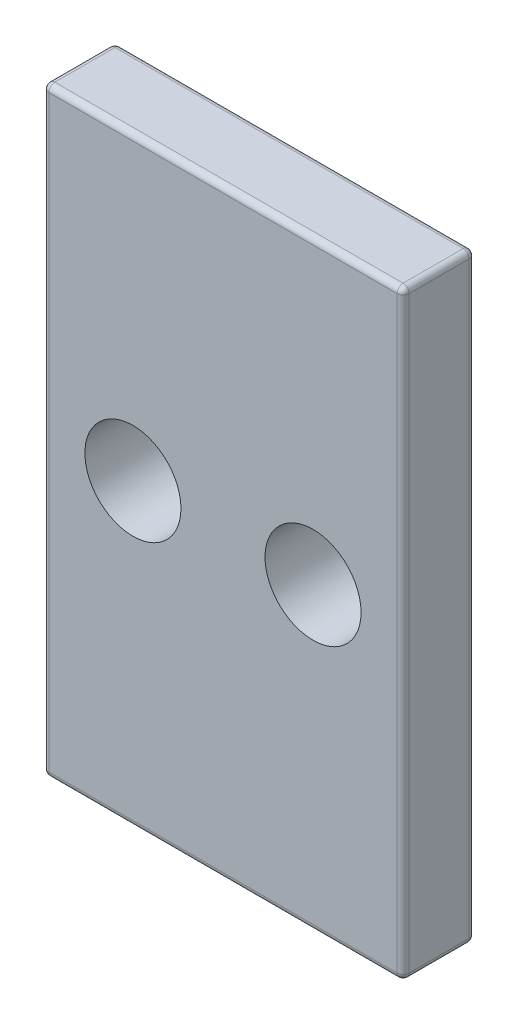
ISO-10303-21;
HEADER;
FILE_DESCRIPTION(('STEP AP214'),'2;1');
FILE_NAME('part.step','',(''),(''),'','','');
FILE_SCHEMA(('AUTOMOTIVE_DESIGN { 1 0 10303 214 1 1 1 1 }'));
ENDSEC;
DATA;
#1=APPLICATION_CONTEXT('core data for automotive mechanical design processes');
#2=APPLICATION_PROTOCOL_DEFINITION('international standard','automotive_design',2000,#1);
#3=PRODUCT_CONTEXT('',#1,'mechanical');
#4=PRODUCT('Part','Part','',(#3));
#5=PRODUCT_RELATED_PRODUCT_CATEGORY('part','',(#4));
#6=PRODUCT_DEFINITION_FORMATION('','',#4);
#7=PRODUCT_DEFINITION_CONTEXT('part definition',#1,'design');
#8=PRODUCT_DEFINITION('design','',#6,#7);
#9=PRODUCT_DEFINITION_SHAPE('','',#8);
#10=(LENGTH_UNIT() NAMED_UNIT(*) SI_UNIT(.MILLI.,.METRE.));
#11=(NAMED_UNIT(*) PLANE_ANGLE_UNIT() SI_UNIT($,.RADIAN.));
#12=(NAMED_UNIT(*) SI_UNIT($,.STERADIAN.) SOLID_ANGLE_UNIT());
#13=UNCERTAINTY_MEASURE_WITH_UNIT(LENGTH_MEASURE(1.E-05),#10,'distance_accuracy_value','');
#14=(GEOMETRIC_REPRESENTATION_CONTEXT(3) GLOBAL_UNCERTAINTY_ASSIGNED_CONTEXT((#13)) GLOBAL_UNIT_ASSIGNED_CONTEXT((#10,
#11,#12)) REPRESENTATION_CONTEXT('',''));
#15=CARTESIAN_POINT('',(0.,0.,0.));
#16=DIRECTION('',(0.,0.,1.));
#17=DIRECTION('',(1.,0.,0.));
#18=AXIS2_PLACEMENT_3D('',#15,#16,#17);
#19=CARTESIAN_POINT('',(0.,0.,6.));
#20=DIRECTION('',(0.,0.,1.));
#21=DIRECTION('',(1.,0.,0.));
#22=AXIS2_PLACEMENT_3D('',#19,#20,#21);
#23=PLANE('',#22);
#24=DIRECTION('',(0.,1.,0.));
#25=VECTOR('',#24,1.);
#26=CARTESIAN_POINT('',(14.5,25.,6.));
#27=LINE('',#26,#25);
#28=CARTESIAN_POINT('',(14.5,-24.5,6.));
#29=VERTEX_POINT('',#28);
#30=CARTESIAN_POINT('',(14.5,24.5,6.));
#31=VERTEX_POINT('',#30);
#32=EDGE_CURVE('E171',#29,#31,#27,.T.);
#33=ORIENTED_EDGE('',*,*,#32,.T.);
#34=DIRECTION('',(-1.,0.,0.));
#35=VECTOR('',#34,1.);
#36=CARTESIAN_POINT('',(-15.,24.5,6.));
#37=LINE('',#36,#35);
#38=CARTESIAN_POINT('',(-14.5,24.5,6.));
#39=VERTEX_POINT('',#38);
#40=EDGE_CURVE('E140',#31,#39,#37,.T.);
#41=ORIENTED_EDGE('',*,*,#40,.T.);
#42=DIRECTION('',(0.,-1.,0.));
#43=VECTOR('',#42,1.);
#44=CARTESIAN_POINT('',(-14.5,-25.,6.));
#45=LINE('',#44,#43);
#46=CARTESIAN_POINT('',(-14.5,-24.5,6.));
#47=VERTEX_POINT('',#46);
#48=EDGE_CURVE('E159',#39,#47,#45,.T.);
#49=ORIENTED_EDGE('',*,*,#48,.T.);
#50=DIRECTION('',(1.,0.,0.));
#51=VECTOR('',#50,1.);
#52=CARTESIAN_POINT('',(15.,-24.5,6.));
#53=LINE('',#52,#51);
#54=EDGE_CURVE('E166',#47,#29,#53,.T.);
#55=ORIENTED_EDGE('',*,*,#54,.T.);
#56=EDGE_LOOP('',(#33,#41,#49,#55));
#57=FACE_BOUND('',#56,.T.);
#58=CARTESIAN_POINT('',(-7.5,0.,6.));
#59=DIRECTION('',(0.,0.,1.));
#60=DIRECTION('',(1.,0.,0.));
#61=AXIS2_PLACEMENT_3D('',#58,#59,#60);
#62=CIRCLE('',#61,4.);
#63=CARTESIAN_POINT('',(-3.5,0.,6.));
#64=VERTEX_POINT('',#63);
#65=EDGE_CURVE('E167',#64,#64,#62,.T.);
#66=ORIENTED_EDGE('',*,*,#65,.F.);
#67=EDGE_LOOP('',(#66));
#68=FACE_BOUND('',#67,.T.);
#69=CARTESIAN_POINT('',(7.5,0.,6.));
#70=DIRECTION('',(0.,0.,1.));
#71=DIRECTION('',(1.,0.,0.));
#72=AXIS2_PLACEMENT_3D('',#69,#70,#71);
#73=CIRCLE('',#72,4.);
#74=CARTESIAN_POINT('',(11.5,0.,6.));
#75=VERTEX_POINT('',#74);
#76=EDGE_CURVE('E320',#75,#75,#73,.T.);
#77=ORIENTED_EDGE('',*,*,#76,.F.);
#78=EDGE_LOOP('',(#77));
#79=FACE_BOUND('',#78,.T.);
#80=ADVANCED_FACE('F45',(#57,#68,#79),#23,.T.);
#81=CARTESIAN_POINT('',(0.,0.,0.));
#82=DIRECTION('',(0.,0.,1.));
#83=DIRECTION('',(1.,0.,0.));
#84=AXIS2_PLACEMENT_3D('',#81,#82,#83);
#85=PLANE('',#84);
#86=DIRECTION('',(0.,-1.,0.));
#87=VECTOR('',#86,1.);
#88=CARTESIAN_POINT('',(-14.5,0.,0.));
#89=LINE('',#88,#87);
#90=CARTESIAN_POINT('',(-14.5,-24.5,0.));
#91=VERTEX_POINT('',#90);
#92=CARTESIAN_POINT('',(-14.5,24.5,0.));
#93=VERTEX_POINT('',#92);
#94=EDGE_CURVE('E190',#91,#93,#89,.F.);
#95=ORIENTED_EDGE('',*,*,#94,.T.);
#96=DIRECTION('',(-1.,0.,0.));
#97=VECTOR('',#96,1.);
#98=CARTESIAN_POINT('',(0.,24.5,0.));
#99=LINE('',#98,#97);
#100=CARTESIAN_POINT('',(14.5,24.5,0.));
#101=VERTEX_POINT('',#100);
#102=EDGE_CURVE('E199',#93,#101,#99,.F.);
#103=ORIENTED_EDGE('',*,*,#102,.T.);
#104=DIRECTION('',(0.,1.,0.));
#105=VECTOR('',#104,1.);
#106=CARTESIAN_POINT('',(14.5,0.,0.));
#107=LINE('',#106,#105);
#108=CARTESIAN_POINT('',(14.5,-24.5,0.));
#109=VERTEX_POINT('',#108);
#110=EDGE_CURVE('E196',#101,#109,#107,.F.);
#111=ORIENTED_EDGE('',*,*,#110,.T.);
#112=DIRECTION('',(1.,0.,0.));
#113=VECTOR('',#112,1.);
#114=CARTESIAN_POINT('',(0.,-24.5,0.));
#115=LINE('',#114,#113);
#116=EDGE_CURVE('E193',#109,#91,#115,.F.);
#117=ORIENTED_EDGE('',*,*,#116,.T.);
#118=EDGE_LOOP('',(#95,#103,#111,#117));
#119=FACE_BOUND('',#118,.T.);
#120=CARTESIAN_POINT('',(-7.5,0.,0.));
#121=DIRECTION('',(0.,0.,1.));
#122=DIRECTION('',(1.,0.,0.));
#123=AXIS2_PLACEMENT_3D('',#120,#121,#122);
#124=CIRCLE('',#123,4.);
#125=CARTESIAN_POINT('',(-3.5,0.,0.));
#126=VERTEX_POINT('',#125);
#127=EDGE_CURVE('E326',#126,#126,#124,.T.);
#128=ORIENTED_EDGE('',*,*,#127,.T.);
#129=EDGE_LOOP('',(#128));
#130=FACE_BOUND('',#129,.T.);
#131=CARTESIAN_POINT('',(7.5,0.,0.));
#132=DIRECTION('',(0.,0.,1.));
#133=DIRECTION('',(1.,0.,0.));
#134=AXIS2_PLACEMENT_3D('',#131,#132,#133);
#135=CIRCLE('',#134,4.);
#136=CARTESIAN_POINT('',(11.5,0.,0.));
#137=VERTEX_POINT('',#136);
#138=EDGE_CURVE('E313',#137,#137,#135,.T.);
#139=ORIENTED_EDGE('',*,*,#138,.T.);
#140=EDGE_LOOP('',(#139));
#141=FACE_BOUND('',#140,.T.);
#142=ADVANCED_FACE('F389',(#119,#130,#141),#85,.F.);
#143=CARTESIAN_POINT('',(15.,25.,6.));
#144=DIRECTION('',(-1.,0.,0.));
#145=DIRECTION('',(0.,-1.,0.));
#146=AXIS2_PLACEMENT_3D('',#143,#144,#145);
#147=PLANE('',#146);
#148=DIRECTION('',(0.,0.,-1.));
#149=VECTOR('',#148,1.);
#150=CARTESIAN_POINT('',(15.,24.5,6.));
#151=LINE('',#150,#149);
#152=CARTESIAN_POINT('',(15.,24.5,0.5));
#153=VERTEX_POINT('',#152);
#154=CARTESIAN_POINT('',(15.,24.5,5.5));
#155=VERTEX_POINT('',#154);
#156=EDGE_CURVE('E209',#153,#155,#151,.F.);
#157=ORIENTED_EDGE('',*,*,#156,.T.);
#158=DIRECTION('',(0.,1.,0.));
#159=VECTOR('',#158,1.);
#160=CARTESIAN_POINT('',(15.,-25.,5.5));
#161=LINE('',#160,#159);
#162=CARTESIAN_POINT('',(15.,-24.5,5.5));
#163=VERTEX_POINT('',#162);
#164=EDGE_CURVE('E212',#155,#163,#161,.F.);
#165=ORIENTED_EDGE('',*,*,#164,.T.);
#166=DIRECTION('',(0.,0.,-1.));
#167=VECTOR('',#166,1.);
#168=CARTESIAN_POINT('',(15.,-24.5,6.));
#169=LINE('',#168,#167);
#170=CARTESIAN_POINT('',(15.,-24.5,0.5));
#171=VERTEX_POINT('',#170);
#172=EDGE_CURVE('E203',#163,#171,#169,.T.);
#173=ORIENTED_EDGE('',*,*,#172,.T.);
#174=DIRECTION('',(0.,1.,0.));
#175=VECTOR('',#174,1.);
#176=CARTESIAN_POINT('',(15.,25.,0.5));
#177=LINE('',#176,#175);
#178=EDGE_CURVE('E206',#171,#153,#177,.T.);
#179=ORIENTED_EDGE('',*,*,#178,.T.);
#180=EDGE_LOOP('',(#157,#165,#173,#179));
#181=FACE_BOUND('',#180,.T.);
#182=ADVANCED_FACE('F395',(#181),#147,.F.);
#183=CARTESIAN_POINT('',(-15.,25.,6.));
#184=DIRECTION('',(0.,-1.,0.));
#185=DIRECTION('',(0.,0.,-1.));
#186=AXIS2_PLACEMENT_3D('',#183,#184,#185);
#187=PLANE('',#186);
#188=DIRECTION('',(-1.,0.,0.));
#189=VECTOR('',#188,1.);
#190=CARTESIAN_POINT('',(15.,25.,5.5));
#191=LINE('',#190,#189);
#192=CARTESIAN_POINT('',(-14.5,25.,5.5));
#193=VERTEX_POINT('',#192);
#194=CARTESIAN_POINT('',(14.5,25.,5.5));
#195=VERTEX_POINT('',#194);
#196=EDGE_CURVE('E142',#193,#195,#191,.F.);
#197=ORIENTED_EDGE('',*,*,#196,.T.);
#198=DIRECTION('',(0.,0.,-1.));
#199=VECTOR('',#198,1.);
#200=CARTESIAN_POINT('',(14.5,25.,6.));
#201=LINE('',#200,#199);
#202=CARTESIAN_POINT('',(14.5,25.,0.5));
#203=VERTEX_POINT('',#202);
#204=EDGE_CURVE('E187',#195,#203,#201,.T.);
#205=ORIENTED_EDGE('',*,*,#204,.T.);
#206=DIRECTION('',(-1.,0.,0.));
#207=VECTOR('',#206,1.);
#208=CARTESIAN_POINT('',(-15.,25.,0.5));
#209=LINE('',#208,#207);
#210=CARTESIAN_POINT('',(-14.5,25.,0.5));
#211=VERTEX_POINT('',#210);
#212=EDGE_CURVE('E178',#203,#211,#209,.T.);
#213=ORIENTED_EDGE('',*,*,#212,.T.);
#214=DIRECTION('',(0.,0.,-1.));
#215=VECTOR('',#214,1.);
#216=CARTESIAN_POINT('',(-14.5,25.,6.));
#217=LINE('',#216,#215);
#218=EDGE_CURVE('E174',#211,#193,#217,.F.);
#219=ORIENTED_EDGE('',*,*,#218,.T.);
#220=EDGE_LOOP('',(#197,#205,#213,#219));
#221=FACE_BOUND('',#220,.T.);
#222=ADVANCED_FACE('F359',(#221),#187,.F.);
#223=CARTESIAN_POINT('',(-15.,25.,6.));
#224=DIRECTION('',(1.,0.,0.));
#225=DIRECTION('',(0.,1.,0.));
#226=AXIS2_PLACEMENT_3D('',#223,#224,#225);
#227=PLANE('',#226);
#228=DIRECTION('',(0.,-1.,0.));
#229=VECTOR('',#228,1.);
#230=CARTESIAN_POINT('',(-15.,25.,5.5));
#231=LINE('',#230,#229);
#232=CARTESIAN_POINT('',(-15.,-24.5,5.5));
#233=VERTEX_POINT('',#232);
#234=CARTESIAN_POINT('',(-15.,24.5,5.5));
#235=VERTEX_POINT('',#234);
#236=EDGE_CURVE('E55',#233,#235,#231,.F.);
#237=ORIENTED_EDGE('',*,*,#236,.T.);
#238=DIRECTION('',(0.,0.,-1.));
#239=VECTOR('',#238,1.);
#240=CARTESIAN_POINT('',(-15.,24.5,6.));
#241=LINE('',#240,#239);
#242=CARTESIAN_POINT('',(-15.,24.5,0.5));
#243=VERTEX_POINT('',#242);
#244=EDGE_CURVE('E11',#235,#243,#241,.T.);
#245=ORIENTED_EDGE('',*,*,#244,.T.);
#246=DIRECTION('',(0.,-1.,0.));
#247=VECTOR('',#246,1.);
#248=CARTESIAN_POINT('',(-15.,25.,0.5));
#249=LINE('',#248,#247);
#250=CARTESIAN_POINT('',(-15.,-24.5,0.5));
#251=VERTEX_POINT('',#250);
#252=EDGE_CURVE('E229',#243,#251,#249,.T.);
#253=ORIENTED_EDGE('',*,*,#252,.T.);
#254=DIRECTION('',(0.,0.,-1.));
#255=VECTOR('',#254,1.);
#256=CARTESIAN_POINT('',(-15.,-24.5,6.));
#257=LINE('',#256,#255);
#258=EDGE_CURVE('E66',#251,#233,#257,.F.);
#259=ORIENTED_EDGE('',*,*,#258,.T.);
#260=EDGE_LOOP('',(#237,#245,#253,#259));
#261=FACE_BOUND('',#260,.T.);
#262=ADVANCED_FACE('F365',(#261),#227,.F.);
#263=CARTESIAN_POINT('',(-15.,-25.,6.));
#264=DIRECTION('',(0.,1.,0.));
#265=DIRECTION('',(0.,0.,1.));
#266=AXIS2_PLACEMENT_3D('',#263,#264,#265);
#267=PLANE('',#266);
#268=DIRECTION('',(0.,0.,-1.));
#269=VECTOR('',#268,1.);
#270=CARTESIAN_POINT('',(14.5,-25.,6.));
#271=LINE('',#270,#269);
#272=CARTESIAN_POINT('',(14.5,-25.,0.5));
#273=VERTEX_POINT('',#272);
#274=CARTESIAN_POINT('',(14.5,-25.,5.5));
#275=VERTEX_POINT('',#274);
#276=EDGE_CURVE('E222',#273,#275,#271,.F.);
#277=ORIENTED_EDGE('',*,*,#276,.T.);
#278=DIRECTION('',(1.,0.,0.));
#279=VECTOR('',#278,1.);
#280=CARTESIAN_POINT('',(-15.,-25.,5.5));
#281=LINE('',#280,#279);
#282=CARTESIAN_POINT('',(-14.5,-25.,5.5));
#283=VERTEX_POINT('',#282);
#284=EDGE_CURVE('E225',#275,#283,#281,.F.);
#285=ORIENTED_EDGE('',*,*,#284,.T.);
#286=DIRECTION('',(0.,0.,-1.));
#287=VECTOR('',#286,1.);
#288=CARTESIAN_POINT('',(-14.5,-25.,6.));
#289=LINE('',#288,#287);
#290=CARTESIAN_POINT('',(-14.5,-25.,0.5));
#291=VERTEX_POINT('',#290);
#292=EDGE_CURVE('E216',#283,#291,#289,.T.);
#293=ORIENTED_EDGE('',*,*,#292,.T.);
#294=DIRECTION('',(1.,0.,0.));
#295=VECTOR('',#294,1.);
#296=CARTESIAN_POINT('',(-15.,-25.,0.5));
#297=LINE('',#296,#295);
#298=EDGE_CURVE('E219',#291,#273,#297,.T.);
#299=ORIENTED_EDGE('',*,*,#298,.T.);
#300=EDGE_LOOP('',(#277,#285,#293,#299));
#301=FACE_BOUND('',#300,.T.);
#302=ADVANCED_FACE('F402',(#301),#267,.F.);
#303=CARTESIAN_POINT('',(-7.5,0.,6.));
#304=DIRECTION('',(0.,0.,-1.));
#305=DIRECTION('',(-1.,0.,0.));
#306=AXIS2_PLACEMENT_3D('',#303,#304,#305);
#307=CYLINDRICAL_SURFACE('',#306,4.);
#308=ORIENTED_EDGE('',*,*,#65,.T.);
#309=EDGE_LOOP('',(#308));
#310=FACE_BOUND('',#309,.T.);
#311=ORIENTED_EDGE('',*,*,#127,.F.);
#312=EDGE_LOOP('',(#311));
#313=FACE_BOUND('',#312,.T.);
#314=ADVANCED_FACE('F399',(#310,#313),#307,.F.);
#315=CARTESIAN_POINT('',(7.5,0.,6.));
#316=DIRECTION('',(0.,0.,-1.));
#317=DIRECTION('',(-1.,0.,0.));
#318=AXIS2_PLACEMENT_3D('',#315,#316,#317);
#319=CYLINDRICAL_SURFACE('',#318,4.);
#320=ORIENTED_EDGE('',*,*,#76,.T.);
#321=EDGE_LOOP('',(#320));
#322=FACE_BOUND('',#321,.T.);
#323=ORIENTED_EDGE('',*,*,#138,.F.);
#324=EDGE_LOOP('',(#323));
#325=FACE_BOUND('',#324,.T.);
#326=ADVANCED_FACE('F558',(#322,#325),#319,.F.);
#327=CARTESIAN_POINT('',(-15.,-24.5,0.5));
#328=DIRECTION('',(1.,0.,0.));
#329=DIRECTION('',(0.,0.,-1.));
#330=AXIS2_PLACEMENT_3D('',#327,#328,#329);
#331=CYLINDRICAL_SURFACE('',#330,0.5);
#332=CARTESIAN_POINT('',(14.5,-24.5,0.5));
#333=DIRECTION('',(1.,0.,0.));
#334=DIRECTION('',(0.,0.,-1.));
#335=AXIS2_PLACEMENT_3D('',#332,#333,#334);
#336=CIRCLE('',#335,0.5);
#337=EDGE_CURVE('E49',#273,#109,#336,.T.);
#338=ORIENTED_EDGE('',*,*,#337,.F.);
#339=ORIENTED_EDGE('',*,*,#298,.F.);
#340=CARTESIAN_POINT('',(-14.5,-24.5,0.5));
#341=DIRECTION('',(-1.,0.,0.));
#342=DIRECTION('',(0.,0.,1.));
#343=AXIS2_PLACEMENT_3D('',#340,#341,#342);
#344=CIRCLE('',#343,0.5);
#345=EDGE_CURVE('E304',#91,#291,#344,.T.);
#346=ORIENTED_EDGE('',*,*,#345,.F.);
#347=ORIENTED_EDGE('',*,*,#116,.F.);
#348=EDGE_LOOP('',(#338,#339,#346,#347));
#349=FACE_BOUND('',#348,.T.);
#350=ADVANCED_FACE('F47',(#349),#331,.T.);
#351=CARTESIAN_POINT('',(14.5,-24.5,0.5));
#352=DIRECTION('',(0.,0.,-1.));
#353=DIRECTION('',(-1.,0.,0.));
#354=AXIS2_PLACEMENT_3D('',#351,#352,#353);
#355=SPHERICAL_SURFACE('',#354,0.5);
#356=CARTESIAN_POINT('',(14.5,-24.5,0.5));
#357=DIRECTION('',(0.,0.,-1.));
#358=DIRECTION('',(-1.,0.,0.));
#359=AXIS2_PLACEMENT_3D('',#356,#357,#358);
#360=CIRCLE('',#359,0.5);
#361=EDGE_CURVE('E297',#273,#171,#360,.F.);
#362=ORIENTED_EDGE('',*,*,#361,.F.);
#363=ORIENTED_EDGE('',*,*,#337,.T.);
#364=CARTESIAN_POINT('',(14.5,-24.5,0.5));
#365=DIRECTION('',(0.,-1.,0.));
#366=DIRECTION('',(0.,0.,-1.));
#367=AXIS2_PLACEMENT_3D('',#364,#365,#366);
#368=CIRCLE('',#367,0.5);
#369=EDGE_CURVE('E301',#171,#109,#368,.F.);
#370=ORIENTED_EDGE('',*,*,#369,.F.);
#371=EDGE_LOOP('',(#362,#363,#370));
#372=FACE_BOUND('',#371,.T.);
#373=ADVANCED_FACE('F544',(#372),#355,.T.);
#374=CARTESIAN_POINT('',(-14.5,-24.5,0.5));
#375=DIRECTION('',(0.,-1.,0.));
#376=DIRECTION('',(0.,0.,-1.));
#377=AXIS2_PLACEMENT_3D('',#374,#375,#376);
#378=SPHERICAL_SURFACE('',#377,0.5);
#379=CARTESIAN_POINT('',(-14.5,-24.5,0.5));
#380=DIRECTION('',(0.,-1.,0.));
#381=DIRECTION('',(0.,0.,-1.));
#382=AXIS2_PLACEMENT_3D('',#379,#380,#381);
#383=CIRCLE('',#382,0.5);
#384=EDGE_CURVE('E289',#91,#251,#383,.F.);
#385=ORIENTED_EDGE('',*,*,#384,.F.);
#386=ORIENTED_EDGE('',*,*,#345,.T.);
#387=CARTESIAN_POINT('',(-14.5,-24.5,0.5));
#388=DIRECTION('',(0.,0.,-1.));
#389=DIRECTION('',(-1.,0.,0.));
#390=AXIS2_PLACEMENT_3D('',#387,#388,#389);
#391=CIRCLE('',#390,0.5);
#392=EDGE_CURVE('E293',#251,#291,#391,.F.);
#393=ORIENTED_EDGE('',*,*,#392,.F.);
#394=EDGE_LOOP('',(#385,#386,#393));
#395=FACE_BOUND('',#394,.T.);
#396=ADVANCED_FACE('F371',(#395),#378,.T.);
#397=CARTESIAN_POINT('',(14.5,25.,0.5));
#398=DIRECTION('',(0.,1.,0.));
#399=DIRECTION('',(-1.,0.,0.));
#400=AXIS2_PLACEMENT_3D('',#397,#398,#399);
#401=CYLINDRICAL_SURFACE('',#400,0.5);
#402=ORIENTED_EDGE('',*,*,#369,.T.);
#403=ORIENTED_EDGE('',*,*,#110,.F.);
#404=CARTESIAN_POINT('',(14.5,24.5,0.5));
#405=DIRECTION('',(0.,1.,0.));
#406=DIRECTION('',(0.,0.,1.));
#407=AXIS2_PLACEMENT_3D('',#404,#405,#406);
#408=CIRCLE('',#407,0.5);
#409=EDGE_CURVE('E282',#153,#101,#408,.T.);
#410=ORIENTED_EDGE('',*,*,#409,.F.);
#411=ORIENTED_EDGE('',*,*,#178,.F.);
#412=EDGE_LOOP('',(#402,#403,#410,#411));
#413=FACE_BOUND('',#412,.T.);
#414=ADVANCED_FACE('F527',(#413),#401,.T.);
#415=CARTESIAN_POINT('',(14.5,-24.5,6.));
#416=DIRECTION('',(0.,0.,-1.));
#417=DIRECTION('',(-1.,0.,0.));
#418=AXIS2_PLACEMENT_3D('',#415,#416,#417);
#419=CYLINDRICAL_SURFACE('',#418,0.5);
#420=ORIENTED_EDGE('',*,*,#361,.T.);
#421=ORIENTED_EDGE('',*,*,#172,.F.);
#422=CARTESIAN_POINT('',(14.5,-24.5,5.5));
#423=DIRECTION('',(0.,0.,1.));
#424=DIRECTION('',(1.,0.,0.));
#425=AXIS2_PLACEMENT_3D('',#422,#423,#424);
#426=CIRCLE('',#425,0.5);
#427=EDGE_CURVE('E278',#275,#163,#426,.T.);
#428=ORIENTED_EDGE('',*,*,#427,.F.);
#429=ORIENTED_EDGE('',*,*,#276,.F.);
#430=EDGE_LOOP('',(#420,#421,#428,#429));
#431=FACE_BOUND('',#430,.T.);
#432=ADVANCED_FACE('F519',(#431),#419,.T.);
#433=CARTESIAN_POINT('',(0.,-24.5,5.5));
#434=DIRECTION('',(-1.,0.,0.));
#435=DIRECTION('',(0.,0.,1.));
#436=AXIS2_PLACEMENT_3D('',#433,#434,#435);
#437=CYLINDRICAL_SURFACE('',#436,0.5);
#438=CARTESIAN_POINT('',(-14.5,-24.5,5.5));
#439=DIRECTION('',(-1.,0.,0.));
#440=DIRECTION('',(0.,0.,1.));
#441=AXIS2_PLACEMENT_3D('',#438,#439,#440);
#442=CIRCLE('',#441,0.5);
#443=EDGE_CURVE('E270',#283,#47,#442,.T.);
#444=ORIENTED_EDGE('',*,*,#443,.F.);
#445=ORIENTED_EDGE('',*,*,#284,.F.);
#446=CARTESIAN_POINT('',(14.5,-24.5,5.5));
#447=DIRECTION('',(1.,0.,0.));
#448=DIRECTION('',(0.,0.,-1.));
#449=AXIS2_PLACEMENT_3D('',#446,#447,#448);
#450=CIRCLE('',#449,0.5);
#451=EDGE_CURVE('E274',#29,#275,#450,.T.);
#452=ORIENTED_EDGE('',*,*,#451,.F.);
#453=ORIENTED_EDGE('',*,*,#54,.F.);
#454=EDGE_LOOP('',(#444,#445,#452,#453));
#455=FACE_BOUND('',#454,.T.);
#456=ADVANCED_FACE('F340',(#455),#437,.T.);
#457=CARTESIAN_POINT('',(-14.5,-24.5,6.));
#458=DIRECTION('',(0.,0.,-1.));
#459=DIRECTION('',(-1.,0.,0.));
#460=AXIS2_PLACEMENT_3D('',#457,#458,#459);
#461=CYLINDRICAL_SURFACE('',#460,0.5);
#462=ORIENTED_EDGE('',*,*,#392,.T.);
#463=ORIENTED_EDGE('',*,*,#292,.F.);
#464=CARTESIAN_POINT('',(-14.5,-24.5,5.5));
#465=DIRECTION('',(0.,0.,1.));
#466=DIRECTION('',(1.,0.,0.));
#467=AXIS2_PLACEMENT_3D('',#464,#465,#466);
#468=CIRCLE('',#467,0.5);
#469=EDGE_CURVE('E267',#233,#283,#468,.T.);
#470=ORIENTED_EDGE('',*,*,#469,.F.);
#471=ORIENTED_EDGE('',*,*,#258,.F.);
#472=EDGE_LOOP('',(#462,#463,#470,#471));
#473=FACE_BOUND('',#472,.T.);
#474=ADVANCED_FACE('F374',(#473),#461,.T.);
#475=CARTESIAN_POINT('',(-14.5,25.,0.5));
#476=DIRECTION('',(0.,-1.,0.));
#477=DIRECTION('',(1.,0.,0.));
#478=AXIS2_PLACEMENT_3D('',#475,#476,#477);
#479=CYLINDRICAL_SURFACE('',#478,0.5);
#480=ORIENTED_EDGE('',*,*,#384,.T.);
#481=ORIENTED_EDGE('',*,*,#252,.F.);
#482=CARTESIAN_POINT('',(-14.5,24.5,0.5));
#483=DIRECTION('',(0.,1.,0.));
#484=DIRECTION('',(0.,0.,1.));
#485=AXIS2_PLACEMENT_3D('',#482,#483,#484);
#486=CIRCLE('',#485,0.5);
#487=EDGE_CURVE('E263',#93,#243,#486,.T.);
#488=ORIENTED_EDGE('',*,*,#487,.F.);
#489=ORIENTED_EDGE('',*,*,#94,.F.);
#490=EDGE_LOOP('',(#480,#481,#488,#489));
#491=FACE_BOUND('',#490,.T.);
#492=ADVANCED_FACE('F370',(#491),#479,.T.);
#493=CARTESIAN_POINT('',(-15.,24.5,0.5));
#494=DIRECTION('',(-1.,0.,0.));
#495=DIRECTION('',(0.,0.,1.));
#496=AXIS2_PLACEMENT_3D('',#493,#494,#495);
#497=CYLINDRICAL_SURFACE('',#496,0.5);
#498=CARTESIAN_POINT('',(14.5,24.5,0.5));
#499=DIRECTION('',(1.,0.,0.));
#500=DIRECTION('',(0.,0.,-1.));
#501=AXIS2_PLACEMENT_3D('',#498,#499,#500);
#502=CIRCLE('',#501,0.5);
#503=EDGE_CURVE('E285',#101,#203,#502,.T.);
#504=ORIENTED_EDGE('',*,*,#503,.F.);
#505=ORIENTED_EDGE('',*,*,#102,.F.);
#506=CARTESIAN_POINT('',(-14.5,24.5,0.5));
#507=DIRECTION('',(-1.,0.,0.));
#508=DIRECTION('',(0.,0.,1.));
#509=AXIS2_PLACEMENT_3D('',#506,#507,#508);
#510=CIRCLE('',#509,0.5);
#511=EDGE_CURVE('E259',#211,#93,#510,.T.);
#512=ORIENTED_EDGE('',*,*,#511,.F.);
#513=ORIENTED_EDGE('',*,*,#212,.F.);
#514=EDGE_LOOP('',(#504,#505,#512,#513));
#515=FACE_BOUND('',#514,.T.);
#516=ADVANCED_FACE('F488',(#515),#497,.T.);
#517=CARTESIAN_POINT('',(14.5,24.5,0.5));
#518=DIRECTION('',(0.,0.,-1.));
#519=DIRECTION('',(-1.,0.,0.));
#520=AXIS2_PLACEMENT_3D('',#517,#518,#519);
#521=SPHERICAL_SURFACE('',#520,0.5);
#522=ORIENTED_EDGE('',*,*,#409,.T.);
#523=ORIENTED_EDGE('',*,*,#503,.T.);
#524=CARTESIAN_POINT('',(14.5,24.5,0.5));
#525=DIRECTION('',(0.,0.,-1.));
#526=DIRECTION('',(-1.,0.,0.));
#527=AXIS2_PLACEMENT_3D('',#524,#525,#526);
#528=CIRCLE('',#527,0.5);
#529=EDGE_CURVE('E255',#153,#203,#528,.F.);
#530=ORIENTED_EDGE('',*,*,#529,.F.);
#531=EDGE_LOOP('',(#522,#523,#530));
#532=FACE_BOUND('',#531,.T.);
#533=ADVANCED_FACE('F386',(#532),#521,.T.);
#534=CARTESIAN_POINT('',(14.5,-24.5,5.5));
#535=DIRECTION('',(0.,-1.,0.));
#536=DIRECTION('',(0.,0.,-1.));
#537=AXIS2_PLACEMENT_3D('',#534,#535,#536);
#538=SPHERICAL_SURFACE('',#537,0.5);
#539=ORIENTED_EDGE('',*,*,#451,.T.);
#540=ORIENTED_EDGE('',*,*,#427,.T.);
#541=CARTESIAN_POINT('',(14.5,-24.5,5.5));
#542=DIRECTION('',(0.,-1.,0.));
#543=DIRECTION('',(0.,0.,-1.));
#544=AXIS2_PLACEMENT_3D('',#541,#542,#543);
#545=CIRCLE('',#544,0.5);
#546=EDGE_CURVE('E252',#29,#163,#545,.F.);
#547=ORIENTED_EDGE('',*,*,#546,.F.);
#548=EDGE_LOOP('',(#539,#540,#547));
#549=FACE_BOUND('',#548,.T.);
#550=ADVANCED_FACE('F343',(#549),#538,.T.);
#551=CARTESIAN_POINT('',(-14.5,-24.5,5.5));
#552=DIRECTION('',(0.,-1.,0.));
#553=DIRECTION('',(0.,0.,-1.));
#554=AXIS2_PLACEMENT_3D('',#551,#552,#553);
#555=SPHERICAL_SURFACE('',#554,0.5);
#556=ORIENTED_EDGE('',*,*,#469,.T.);
#557=ORIENTED_EDGE('',*,*,#443,.T.);
#558=CARTESIAN_POINT('',(-14.5,-24.5,5.5));
#559=DIRECTION('',(0.,-1.,0.));
#560=DIRECTION('',(0.,0.,-1.));
#561=AXIS2_PLACEMENT_3D('',#558,#559,#560);
#562=CIRCLE('',#561,0.5);
#563=EDGE_CURVE('E162',#233,#47,#562,.F.);
#564=ORIENTED_EDGE('',*,*,#563,.F.);
#565=EDGE_LOOP('',(#556,#557,#564));
#566=FACE_BOUND('',#565,.T.);
#567=ADVANCED_FACE('F376',(#566),#555,.T.);
#568=CARTESIAN_POINT('',(-14.5,24.5,0.5));
#569=DIRECTION('',(0.,0.,-1.));
#570=DIRECTION('',(-1.,0.,0.));
#571=AXIS2_PLACEMENT_3D('',#568,#569,#570);
#572=SPHERICAL_SURFACE('',#571,0.5);
#573=ORIENTED_EDGE('',*,*,#511,.T.);
#574=ORIENTED_EDGE('',*,*,#487,.T.);
#575=CARTESIAN_POINT('',(-14.5,24.5,0.5));
#576=DIRECTION('',(0.,0.,-1.));
#577=DIRECTION('',(-1.,0.,0.));
#578=AXIS2_PLACEMENT_3D('',#575,#576,#577);
#579=CIRCLE('',#578,0.5);
#580=EDGE_CURVE('E247',#211,#243,#579,.F.);
#581=ORIENTED_EDGE('',*,*,#580,.F.);
#582=EDGE_LOOP('',(#573,#574,#581));
#583=FACE_BOUND('',#582,.T.);
#584=ADVANCED_FACE('F378',(#583),#572,.T.);
#585=CARTESIAN_POINT('',(14.5,24.5,6.));
#586=DIRECTION('',(0.,0.,-1.));
#587=DIRECTION('',(-1.,0.,0.));
#588=AXIS2_PLACEMENT_3D('',#585,#586,#587);
#589=CYLINDRICAL_SURFACE('',#588,0.5);
#590=ORIENTED_EDGE('',*,*,#529,.T.);
#591=ORIENTED_EDGE('',*,*,#204,.F.);
#592=CARTESIAN_POINT('',(14.5,24.5,5.5));
#593=DIRECTION('',(0.,0.,1.));
#594=DIRECTION('',(1.,0.,0.));
#595=AXIS2_PLACEMENT_3D('',#592,#593,#594);
#596=CIRCLE('',#595,0.5);
#597=EDGE_CURVE('E243',#155,#195,#596,.T.);
#598=ORIENTED_EDGE('',*,*,#597,.F.);
#599=ORIENTED_EDGE('',*,*,#156,.F.);
#600=EDGE_LOOP('',(#590,#591,#598,#599));
#601=FACE_BOUND('',#600,.T.);
#602=ADVANCED_FACE('F355',(#601),#589,.T.);
#603=CARTESIAN_POINT('',(14.5,0.,5.5));
#604=DIRECTION('',(0.,-1.,0.));
#605=DIRECTION('',(1.,0.,0.));
#606=AXIS2_PLACEMENT_3D('',#603,#604,#605);
#607=CYLINDRICAL_SURFACE('',#606,0.5);
#608=ORIENTED_EDGE('',*,*,#546,.T.);
#609=ORIENTED_EDGE('',*,*,#164,.F.);
#610=CARTESIAN_POINT('',(14.5,24.5,5.5));
#611=DIRECTION('',(0.,1.,0.));
#612=DIRECTION('',(0.,0.,1.));
#613=AXIS2_PLACEMENT_3D('',#610,#611,#612);
#614=CIRCLE('',#613,0.5);
#615=EDGE_CURVE('E156',#31,#155,#614,.T.);
#616=ORIENTED_EDGE('',*,*,#615,.F.);
#617=ORIENTED_EDGE('',*,*,#32,.F.);
#618=EDGE_LOOP('',(#608,#609,#616,#617));
#619=FACE_BOUND('',#618,.T.);
#620=ADVANCED_FACE('F347',(#619),#607,.T.);
#621=CARTESIAN_POINT('',(-14.5,0.,5.5));
#622=DIRECTION('',(0.,1.,0.));
#623=DIRECTION('',(-1.,0.,0.));
#624=AXIS2_PLACEMENT_3D('',#621,#622,#623);
#625=CYLINDRICAL_SURFACE('',#624,0.5);
#626=ORIENTED_EDGE('',*,*,#563,.T.);
#627=ORIENTED_EDGE('',*,*,#48,.F.);
#628=CARTESIAN_POINT('',(-14.5,24.5,5.5));
#629=DIRECTION('',(0.,1.,0.));
#630=DIRECTION('',(0.,0.,1.));
#631=AXIS2_PLACEMENT_3D('',#628,#629,#630);
#632=CIRCLE('',#631,0.5);
#633=EDGE_CURVE('E149',#235,#39,#632,.T.);
#634=ORIENTED_EDGE('',*,*,#633,.F.);
#635=ORIENTED_EDGE('',*,*,#236,.F.);
#636=EDGE_LOOP('',(#626,#627,#634,#635));
#637=FACE_BOUND('',#636,.T.);
#638=ADVANCED_FACE('F160',(#637),#625,.T.);
#639=CARTESIAN_POINT('',(-14.5,24.5,6.));
#640=DIRECTION('',(0.,0.,-1.));
#641=DIRECTION('',(-1.,0.,0.));
#642=AXIS2_PLACEMENT_3D('',#639,#640,#641);
#643=CYLINDRICAL_SURFACE('',#642,0.5);
#644=ORIENTED_EDGE('',*,*,#580,.T.);
#645=ORIENTED_EDGE('',*,*,#244,.F.);
#646=CARTESIAN_POINT('',(-14.5,24.5,5.5));
#647=DIRECTION('',(0.,0.,1.));
#648=DIRECTION('',(1.,0.,0.));
#649=AXIS2_PLACEMENT_3D('',#646,#647,#648);
#650=CIRCLE('',#649,0.5);
#651=EDGE_CURVE('E153',#193,#235,#650,.T.);
#652=ORIENTED_EDGE('',*,*,#651,.F.);
#653=ORIENTED_EDGE('',*,*,#218,.F.);
#654=EDGE_LOOP('',(#644,#645,#652,#653));
#655=FACE_BOUND('',#654,.T.);
#656=ADVANCED_FACE('F363',(#655),#643,.T.);
#657=CARTESIAN_POINT('',(14.5,24.5,5.5));
#658=DIRECTION('',(1.,0.,0.));
#659=DIRECTION('',(0.,0.,-1.));
#660=AXIS2_PLACEMENT_3D('',#657,#658,#659);
#661=SPHERICAL_SURFACE('',#660,0.5);
#662=ORIENTED_EDGE('',*,*,#615,.T.);
#663=ORIENTED_EDGE('',*,*,#597,.T.);
#664=CARTESIAN_POINT('',(14.5,24.5,5.5));
#665=DIRECTION('',(1.,0.,0.));
#666=DIRECTION('',(0.,0.,-1.));
#667=AXIS2_PLACEMENT_3D('',#664,#665,#666);
#668=CIRCLE('',#667,0.5);
#669=EDGE_CURVE('E146',#31,#195,#668,.F.);
#670=ORIENTED_EDGE('',*,*,#669,.F.);
#671=EDGE_LOOP('',(#662,#663,#670));
#672=FACE_BOUND('',#671,.T.);
#673=ADVANCED_FACE('F351',(#672),#661,.T.);
#674=CARTESIAN_POINT('',(-14.5,24.5,5.5));
#675=DIRECTION('',(-1.,0.,0.));
#676=DIRECTION('',(0.,0.,1.));
#677=AXIS2_PLACEMENT_3D('',#674,#675,#676);
#678=SPHERICAL_SURFACE('',#677,0.5);
#679=ORIENTED_EDGE('',*,*,#651,.T.);
#680=ORIENTED_EDGE('',*,*,#633,.T.);
#681=CARTESIAN_POINT('',(-14.5,24.5,5.5));
#682=DIRECTION('',(-1.,0.,0.));
#683=DIRECTION('',(0.,0.,1.));
#684=AXIS2_PLACEMENT_3D('',#681,#682,#683);
#685=CIRCLE('',#684,0.5);
#686=EDGE_CURVE('E136',#193,#39,#685,.F.);
#687=ORIENTED_EDGE('',*,*,#686,.F.);
#688=EDGE_LOOP('',(#679,#680,#687));
#689=FACE_BOUND('',#688,.T.);
#690=ADVANCED_FACE('F151',(#689),#678,.T.);
#691=CARTESIAN_POINT('',(0.,24.5,5.5));
#692=DIRECTION('',(1.,0.,0.));
#693=DIRECTION('',(0.,0.,-1.));
#694=AXIS2_PLACEMENT_3D('',#691,#692,#693);
#695=CYLINDRICAL_SURFACE('',#694,0.5);
#696=ORIENTED_EDGE('',*,*,#669,.T.);
#697=ORIENTED_EDGE('',*,*,#196,.F.);
#698=ORIENTED_EDGE('',*,*,#686,.T.);
#699=ORIENTED_EDGE('',*,*,#40,.F.);
#700=EDGE_LOOP('',(#696,#697,#698,#699));
#701=FACE_BOUND('',#700,.T.);
#702=ADVANCED_FACE('F138',(#701),#695,.T.);
#703=CLOSED_SHELL('',(#80,#142,#182,#222,#262,#302,#314,#326,#350,#373,#396,#414,#432,#456,#474,
#492,#516,#533,#550,#567,#584,#602,#620,#638,#656,#673,#690,#702));
#704=MANIFOLD_SOLID_BREP('B2',#703);
#705=ADVANCED_BREP_SHAPE_REPRESENTATION('',(#18,#704),#14);
#706=SHAPE_DEFINITION_REPRESENTATION(#9,#705);
ENDSEC;
END-ISO-10303-21;
